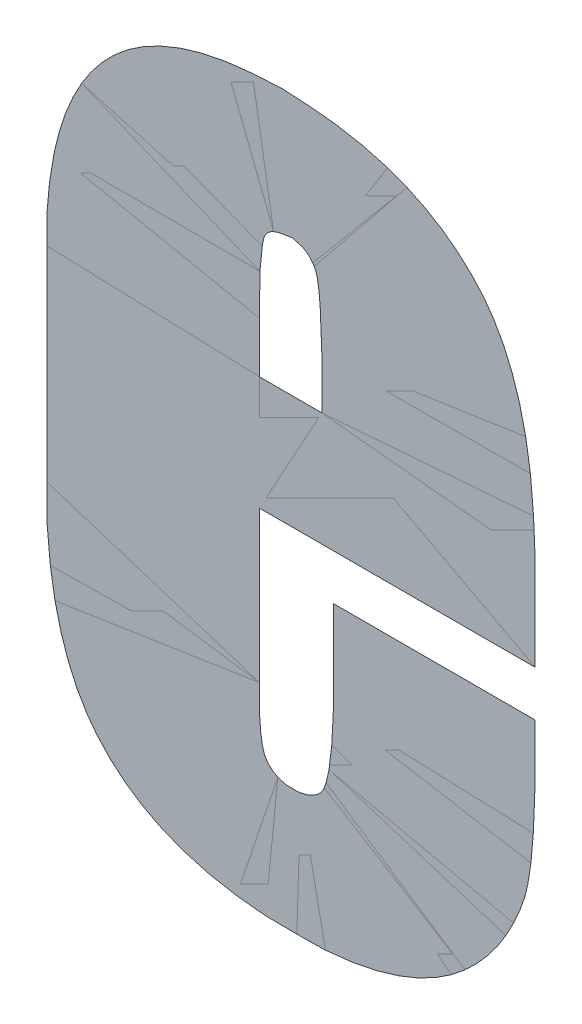
ISO-10303-21;
HEADER;
FILE_DESCRIPTION(('STEP AP214'),'2;1');
FILE_NAME('part.step','',(''),(''),'','','');
FILE_SCHEMA(('AUTOMOTIVE_DESIGN { 1 0 10303 214 1 1 1 1 }'));
ENDSEC;
DATA;
#1=APPLICATION_CONTEXT('core data for automotive mechanical design processes');
#2=APPLICATION_PROTOCOL_DEFINITION('international standard','automotive_design',2000,#1);
#3=PRODUCT_CONTEXT('',#1,'mechanical');
#4=PRODUCT('Part','Part','',(#3));
#5=PRODUCT_RELATED_PRODUCT_CATEGORY('part','',(#4));
#6=PRODUCT_DEFINITION_FORMATION('','',#4);
#7=PRODUCT_DEFINITION_CONTEXT('part definition',#1,'design');
#8=PRODUCT_DEFINITION('design','',#6,#7);
#9=PRODUCT_DEFINITION_SHAPE('','',#8);
#10=(LENGTH_UNIT() NAMED_UNIT(*) SI_UNIT(.MILLI.,.METRE.));
#11=(NAMED_UNIT(*) PLANE_ANGLE_UNIT() SI_UNIT($,.RADIAN.));
#12=(NAMED_UNIT(*) SI_UNIT($,.STERADIAN.) SOLID_ANGLE_UNIT());
#13=UNCERTAINTY_MEASURE_WITH_UNIT(LENGTH_MEASURE(1.E-05),#10,'distance_accuracy_value','');
#14=(GEOMETRIC_REPRESENTATION_CONTEXT(3) GLOBAL_UNCERTAINTY_ASSIGNED_CONTEXT((#13)) GLOBAL_UNIT_ASSIGNED_CONTEXT((#10,
#11,#12)) REPRESENTATION_CONTEXT('',''));
#15=CARTESIAN_POINT('',(0.,0.,0.));
#16=DIRECTION('',(0.,0.,1.));
#17=DIRECTION('',(1.,0.,0.));
#18=AXIS2_PLACEMENT_3D('',#15,#16,#17);
#19=CARTESIAN_POINT('',(6.986694551568,0.774329220897,0.001332));
#20=DIRECTION('',(0.,0.,1.));
#21=DIRECTION('',(1.,0.,0.));
#22=AXIS2_PLACEMENT_3D('',#19,#20,#21);
#23=PLANE('',#22);
#24=CARTESIAN_POINT('',(6.989983208588,0.821690510628,0.001668));
#25=DIRECTION('',(0.,-1.,0.));
#26=VECTOR('',#25,1.);
#27=LINE('',#24,#26);
#28=CARTESIAN_POINT('',(6.989983208588,0.821690510628,0.0015));
#29=VERTEX_POINT('',#28);
#30=CARTESIAN_POINT('',(6.989983208588,0.80835516755,0.0015));
#31=VERTEX_POINT('',#30);
#32=EDGE_CURVE('E11',#29,#31,#27,.T.);
#33=ORIENTED_EDGE('',*,*,#32,.F.);
#34=CARTESIAN_POINT('',(6.982218325277,0.844309953316,0.001668));
#35=CARTESIAN_POINT('',(6.98670198834309,0.84399688503704,0.001668));
#36=CARTESIAN_POINT('',(6.988463992288,0.840174308944,0.001668));
#37=CARTESIAN_POINT('',(6.989983208588,0.836878448043514,0.001668));
#38=CARTESIAN_POINT('',(6.989983208588,0.821690510628,0.001668));
#39=B_SPLINE_CURVE_WITH_KNOTS('',2,(#34,#35,#36,#37,#38),.UNSPECIFIED.,.F.,.F.,(3,2,3),(0.,0.5,
1.),.UNSPECIFIED.);
#40=CARTESIAN_POINT('',(6.982218325277,0.844309953316,0.0015));
#41=VERTEX_POINT('',#40);
#42=EDGE_CURVE('E28',#41,#29,#39,.T.);
#43=ORIENTED_EDGE('',*,*,#42,.F.);
#44=CARTESIAN_POINT('',(6.973609432911,0.821690510628,0.001668));
#45=CARTESIAN_POINT('',(6.973609432911,0.835948392219941,0.001668));
#46=CARTESIAN_POINT('',(6.9749598474,0.840765115283,0.001668));
#47=CARTESIAN_POINT('',(6.97586779419917,0.844003623402723,0.001668));
#48=CARTESIAN_POINT('',(6.982218325277,0.844309953316,0.001668));
#49=B_SPLINE_CURVE_WITH_KNOTS('',2,(#44,#45,#46,#47,#48),.UNSPECIFIED.,.F.,.F.,(3,2,3),(0.,0.5,
1.),.UNSPECIFIED.);
#50=CARTESIAN_POINT('',(6.973609432911,0.821690510628,0.0015));
#51=VERTEX_POINT('',#50);
#52=EDGE_CURVE('E299',#51,#41,#49,.T.);
#53=ORIENTED_EDGE('',*,*,#52,.F.);
#54=CARTESIAN_POINT('',(6.973609432911,0.80835516755,0.001668));
#55=DIRECTION('',(0.,1.,0.));
#56=VECTOR('',#55,1.);
#57=LINE('',#54,#56);
#58=CARTESIAN_POINT('',(6.973609432911,0.80835516755,0.0015));
#59=VERTEX_POINT('',#58);
#60=EDGE_CURVE('E318',#59,#51,#57,.T.);
#61=ORIENTED_EDGE('',*,*,#60,.F.);
#62=CARTESIAN_POINT('',(6.989983208588,0.80835516755,0.001668));
#63=DIRECTION('',(-1.,0.,0.));
#64=VECTOR('',#63,1.);
#65=LINE('',#62,#64);
#66=EDGE_CURVE('E100',#31,#59,#65,.T.);
#67=ORIENTED_EDGE('',*,*,#66,.F.);
#68=EDGE_LOOP('',(#33,#43,#53,#61,#67));
#69=FACE_BOUND('',#68,.T.);
#70=CARTESIAN_POINT('',(6.973609432911,0.738808821375,0.001668));
#71=DIRECTION('',(0.,1.,0.));
#72=VECTOR('',#71,1.);
#73=LINE('',#70,#72);
#74=CARTESIAN_POINT('',(6.973609432911,0.738808821375,0.0015));
#75=VERTEX_POINT('',#74);
#76=CARTESIAN_POINT('',(6.973609432911,0.778477246985,0.0015));
#77=VERTEX_POINT('',#76);
#78=EDGE_CURVE('E89',#75,#77,#73,.T.);
#79=ORIENTED_EDGE('',*,*,#78,.F.);
#80=CARTESIAN_POINT('',(6.982387127088,0.719059009475,0.001668));
#81=CARTESIAN_POINT('',(6.97741622603455,0.719333742862682,0.001668));
#82=CARTESIAN_POINT('',(6.9753818519275,0.722688248414,0.001668));
#83=CARTESIAN_POINT('',(6.973609432911,0.725610812857534,0.001668));
#84=CARTESIAN_POINT('',(6.973609432911,0.738808821375,0.001668));
#85=B_SPLINE_CURVE_WITH_KNOTS('',2,(#80,#81,#82,#83,#84),.UNSPECIFIED.,.F.,.F.,(3,2,3),(0.,0.5,
1.),.UNSPECIFIED.);
#86=CARTESIAN_POINT('',(6.982387127088,0.719059009475,0.0015));
#87=VERTEX_POINT('',#86);
#88=EDGE_CURVE('E98',#87,#75,#85,.T.);
#89=ORIENTED_EDGE('',*,*,#88,.F.);
#90=CARTESIAN_POINT('',(6.993021641188,0.742353659408,0.001668));
#91=CARTESIAN_POINT('',(6.993021641188,0.729800524527954,0.001668));
#92=CARTESIAN_POINT('',(6.9909116185495,0.7238698610915,0.001668));
#93=CARTESIAN_POINT('',(6.98934813876382,0.719475371558851,0.001668));
#94=CARTESIAN_POINT('',(6.982387127088,0.719059009475,0.001668));
#95=B_SPLINE_CURVE_WITH_KNOTS('',2,(#90,#91,#92,#93,#94),.UNSPECIFIED.,.F.,.F.,(3,2,3),(0.,0.5,
1.),.UNSPECIFIED.);
#96=CARTESIAN_POINT('',(6.993021641188,0.742353659408,0.0015));
#97=VERTEX_POINT('',#96);
#98=EDGE_CURVE('E278',#97,#87,#95,.T.);
#99=ORIENTED_EDGE('',*,*,#98,.F.);
#100=CARTESIAN_POINT('',(6.993021641188,0.766492318396,0.001668));
#101=DIRECTION('',(0.,-1.,0.));
#102=VECTOR('',#101,1.);
#103=LINE('',#100,#102);
#104=CARTESIAN_POINT('',(6.993021641188,0.766492318396,0.0015));
#105=VERTEX_POINT('',#104);
#106=EDGE_CURVE('E357',#105,#97,#103,.T.);
#107=ORIENTED_EDGE('',*,*,#106,.F.);
#108=CARTESIAN_POINT('',(7.046025409876,0.766492318396,0.001668));
#109=DIRECTION('',(-1.,0.,0.));
#110=VECTOR('',#109,1.);
#111=LINE('',#108,#110);
#112=CARTESIAN_POINT('',(7.046025409876,0.766492318396,0.0015));
#113=VERTEX_POINT('',#112);
#114=EDGE_CURVE('E358',#113,#105,#111,.T.);
#115=ORIENTED_EDGE('',*,*,#114,.F.);
#116=CARTESIAN_POINT('',(7.046025409876,0.752988173508,0.001668));
#117=DIRECTION('',(0.,1.,0.));
#118=VECTOR('',#117,1.);
#119=LINE('',#116,#118);
#120=CARTESIAN_POINT('',(7.046025409876,0.752988173508,0.0015));
#121=VERTEX_POINT('',#120);
#122=EDGE_CURVE('E359',#121,#113,#119,.T.);
#123=ORIENTED_EDGE('',*,*,#122,.F.);
#124=CARTESIAN_POINT('',(6.983399937955,0.686480259932,0.001668));
#125=CARTESIAN_POINT('',(7.0111133162215,0.686480259932,0.001668));
#126=CARTESIAN_POINT('',(7.02686302827888,0.69984598733484,0.001668));
#127=CARTESIAN_POINT('',(7.03764512387383,0.708996030842199,0.001668));
#128=CARTESIAN_POINT('',(7.04283843168208,0.72312713312268,0.001668));
#129=CARTESIAN_POINT('',(7.046025409876,0.731798969356297,0.001668));
#130=CARTESIAN_POINT('',(7.046025409876,0.752988173508,0.001668));
#131=B_SPLINE_CURVE_WITH_KNOTS('',2,(#124,#125,#126,#127,#128,#129,#130),.UNSPECIFIED.,.F.,.F.,
(3,2,2,3),(0.,0.4,0.7,1.),.UNSPECIFIED.);
#132=CARTESIAN_POINT('',(6.983399937955,0.686480259932,0.0015));
#133=VERTEX_POINT('',#132);
#134=EDGE_CURVE('E268',#133,#121,#131,.T.);
#135=ORIENTED_EDGE('',*,*,#134,.F.);
#136=CARTESIAN_POINT('',(6.917736033435,0.756533011541,0.001668));
#137=CARTESIAN_POINT('',(6.917736033435,0.721709180952235,0.001668));
#138=CARTESIAN_POINT('',(6.931071376512,0.7057236663975,0.001668));
#139=CARTESIAN_POINT('',(6.94712449925065,0.686480259932,0.001668));
#140=CARTESIAN_POINT('',(6.983399937955,0.686480259932,0.001668));
#141=B_SPLINE_CURVE_WITH_KNOTS('',2,(#136,#137,#138,#139,#140),.UNSPECIFIED.,.F.,.F.,(3,2,3),
(0.,0.5,1.),.UNSPECIFIED.);
#142=CARTESIAN_POINT('',(6.917736033435,0.756533011541,0.0015));
#143=VERTEX_POINT('',#142);
#144=EDGE_CURVE('E238',#143,#133,#141,.T.);
#145=ORIENTED_EDGE('',*,*,#144,.F.);
#146=CARTESIAN_POINT('',(6.917736033435,0.810211987473,0.001668));
#147=DIRECTION('',(0.,-1.,0.));
#148=VECTOR('',#147,1.);
#149=LINE('',#146,#148);
#150=CARTESIAN_POINT('',(6.917736033435,0.810211987473,0.0015));
#151=VERTEX_POINT('',#150);
#152=EDGE_CURVE('E233',#151,#143,#149,.T.);
#153=ORIENTED_EDGE('',*,*,#152,.F.);
#154=CARTESIAN_POINT('',(6.9795174963,0.876888702859,0.001668));
#155=CARTESIAN_POINT('',(6.917736033435,0.876888702859,0.001668));
#156=CARTESIAN_POINT('',(6.917736033435,0.810211987473,0.001668));
#157=B_SPLINE_CURVE_WITH_KNOTS('',2,(#154,#155,#156),.UNSPECIFIED.,.F.,.F.,(3,3),(0.,1.),.UNSPECIFIED.);
#158=CARTESIAN_POINT('',(6.9795174963,0.876888702859,0.0015));
#159=VERTEX_POINT('',#158);
#160=EDGE_CURVE('E235',#159,#151,#157,.T.);
#161=ORIENTED_EDGE('',*,*,#160,.F.);
#162=CARTESIAN_POINT('',(7.046025409876,0.802784707784,0.001668));
#163=CARTESIAN_POINT('',(7.046025409876,0.841114964543937,0.001668));
#164=CARTESIAN_POINT('',(7.03142405321513,0.857560895487625,0.001668));
#165=CARTESIAN_POINT('',(7.01426405115331,0.876888702859,0.001668));
#166=CARTESIAN_POINT('',(6.9795174963,0.876888702859,0.001668));
#167=B_SPLINE_CURVE_WITH_KNOTS('',2,(#162,#163,#164,#165,#166),.UNSPECIFIED.,.F.,.F.,(3,2,3),
(0.,0.5,1.),.UNSPECIFIED.);
#168=CARTESIAN_POINT('',(7.046025409876,0.802784707784,0.0015));
#169=VERTEX_POINT('',#168);
#170=EDGE_CURVE('E240',#169,#159,#167,.T.);
#171=ORIENTED_EDGE('',*,*,#170,.F.);
#172=CARTESIAN_POINT('',(7.046025409876,0.778477246985,0.001668));
#173=DIRECTION('',(0.,1.,0.));
#174=VECTOR('',#173,1.);
#175=LINE('',#172,#174);
#176=CARTESIAN_POINT('',(7.046025409876,0.778477246985,0.0015));
#177=VERTEX_POINT('',#176);
#178=EDGE_CURVE('E84',#177,#169,#175,.T.);
#179=ORIENTED_EDGE('',*,*,#178,.F.);
#180=CARTESIAN_POINT('',(6.973609432911,0.778477246985,0.001668));
#181=DIRECTION('',(1.,0.,0.));
#182=VECTOR('',#181,1.);
#183=LINE('',#180,#182);
#184=EDGE_CURVE('E87',#77,#177,#183,.T.);
#185=ORIENTED_EDGE('',*,*,#184,.F.);
#186=EDGE_LOOP('',(#79,#89,#99,#107,#115,#123,#135,#145,#153,#161,#171,#179,#185));
#187=FACE_BOUND('',#186,.T.);
#188=ADVANCED_FACE('F17',(#69,#187),#23,.F.);
#189=CARTESIAN_POINT('',(6.986694551568,0.774329220897,0.001668));
#190=DIRECTION('',(0.,0.,1.));
#191=DIRECTION('',(1.,0.,0.));
#192=AXIS2_PLACEMENT_3D('',#189,#190,#191);
#193=PLANE('',#192);
#194=ORIENTED_EDGE('',*,*,#42,.T.);
#195=ORIENTED_EDGE('',*,*,#32,.T.);
#196=ORIENTED_EDGE('',*,*,#66,.T.);
#197=ORIENTED_EDGE('',*,*,#60,.T.);
#198=ORIENTED_EDGE('',*,*,#52,.T.);
#199=EDGE_LOOP('',(#194,#195,#196,#197,#198));
#200=FACE_BOUND('',#199,.T.);
#201=ORIENTED_EDGE('',*,*,#88,.T.);
#202=ORIENTED_EDGE('',*,*,#78,.T.);
#203=ORIENTED_EDGE('',*,*,#184,.T.);
#204=ORIENTED_EDGE('',*,*,#178,.T.);
#205=ORIENTED_EDGE('',*,*,#170,.T.);
#206=ORIENTED_EDGE('',*,*,#160,.T.);
#207=ORIENTED_EDGE('',*,*,#152,.T.);
#208=ORIENTED_EDGE('',*,*,#144,.T.);
#209=ORIENTED_EDGE('',*,*,#134,.T.);
#210=ORIENTED_EDGE('',*,*,#122,.T.);
#211=ORIENTED_EDGE('',*,*,#114,.T.);
#212=ORIENTED_EDGE('',*,*,#106,.T.);
#213=ORIENTED_EDGE('',*,*,#98,.T.);
#214=EDGE_LOOP('',(#201,#202,#203,#204,#205,#206,#207,#208,#209,#210,#211,#212,#213));
#215=FACE_BOUND('',#214,.T.);
#216=ADVANCED_FACE('F96',(#200,#215),#193,.T.);
#217=CLOSED_SHELL('',(#188,#216));
#218=MANIFOLD_SOLID_BREP('B1',#217);
#219=ADVANCED_BREP_SHAPE_REPRESENTATION('',(#18,#218),#14);
#220=SHAPE_DEFINITION_REPRESENTATION(#9,#219);
ENDSEC;
END-ISO-10303-21;
